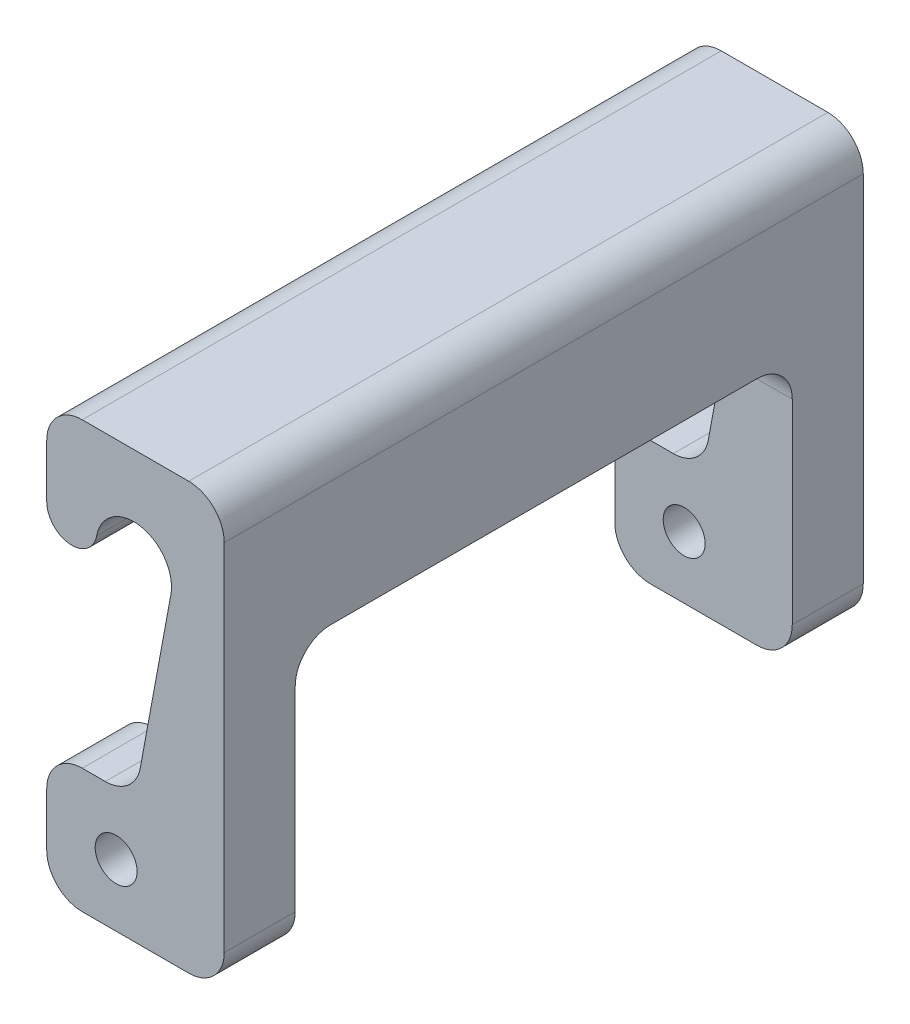
ISO-10303-21;
HEADER;
FILE_DESCRIPTION(('STEP AP214'),'2;1');
FILE_NAME('part.step','',(''),(''),'','','');
FILE_SCHEMA(('AUTOMOTIVE_DESIGN { 1 0 10303 214 1 1 1 1 }'));
ENDSEC;
DATA;
#1=APPLICATION_CONTEXT('core data for automotive mechanical design processes');
#2=APPLICATION_PROTOCOL_DEFINITION('international standard','automotive_design',2000,#1);
#3=PRODUCT_CONTEXT('',#1,'mechanical');
#4=PRODUCT('Part','Part','',(#3));
#5=PRODUCT_RELATED_PRODUCT_CATEGORY('part','',(#4));
#6=PRODUCT_DEFINITION_FORMATION('','',#4);
#7=PRODUCT_DEFINITION_CONTEXT('part definition',#1,'design');
#8=PRODUCT_DEFINITION('design','',#6,#7);
#9=PRODUCT_DEFINITION_SHAPE('','',#8);
#10=(LENGTH_UNIT() NAMED_UNIT(*) SI_UNIT(.MILLI.,.METRE.));
#11=(NAMED_UNIT(*) PLANE_ANGLE_UNIT() SI_UNIT($,.RADIAN.));
#12=(NAMED_UNIT(*) SI_UNIT($,.STERADIAN.) SOLID_ANGLE_UNIT());
#13=UNCERTAINTY_MEASURE_WITH_UNIT(LENGTH_MEASURE(1.E-05),#10,'distance_accuracy_value','');
#14=(GEOMETRIC_REPRESENTATION_CONTEXT(3) GLOBAL_UNCERTAINTY_ASSIGNED_CONTEXT((#13)) GLOBAL_UNIT_ASSIGNED_CONTEXT((#10,
#11,#12)) REPRESENTATION_CONTEXT('',''));
#15=CARTESIAN_POINT('',(0.,0.,0.));
#16=DIRECTION('',(0.,0.,1.));
#17=DIRECTION('',(1.,0.,0.));
#18=AXIS2_PLACEMENT_3D('',#15,#16,#17);
#19=CARTESIAN_POINT('',(0.,8.89,45.72));
#20=DIRECTION('',(0.,-1.,0.));
#21=DIRECTION('',(0.,0.,-1.));
#22=AXIS2_PLACEMENT_3D('',#19,#20,#21);
#23=PLANE('',#22);
#24=DIRECTION('',(0.,0.,-1.));
#25=VECTOR('',#24,1.);
#26=CARTESIAN_POINT('',(4.19391314965813,8.89,45.72));
#27=LINE('',#26,#25);
#28=CARTESIAN_POINT('',(4.19391314965813,8.89,45.72));
#29=VERTEX_POINT('',#28);
#30=CARTESIAN_POINT('',(4.19391314965813,8.89,40.64));
#31=VERTEX_POINT('',#30);
#32=EDGE_CURVE('E235',#29,#31,#27,.T.);
#33=ORIENTED_EDGE('',*,*,#32,.T.);
#34=DIRECTION('',(-1.,0.,0.));
#35=VECTOR('',#34,1.);
#36=CARTESIAN_POINT('',(0.,8.89,40.64));
#37=LINE('',#36,#35);
#38=CARTESIAN_POINT('',(2.54,8.89,40.64));
#39=VERTEX_POINT('',#38);
#40=EDGE_CURVE('E340',#31,#39,#37,.T.);
#41=ORIENTED_EDGE('',*,*,#40,.T.);
#42=DIRECTION('',(0.,0.,-1.));
#43=VECTOR('',#42,1.);
#44=CARTESIAN_POINT('',(2.54,8.89,45.72));
#45=LINE('',#44,#43);
#46=CARTESIAN_POINT('',(2.54,8.89,45.72));
#47=VERTEX_POINT('',#46);
#48=EDGE_CURVE('E272',#47,#39,#45,.T.);
#49=ORIENTED_EDGE('',*,*,#48,.F.);
#50=DIRECTION('',(-1.,0.,0.));
#51=VECTOR('',#50,1.);
#52=CARTESIAN_POINT('',(0.,8.89,45.72));
#53=LINE('',#52,#51);
#54=EDGE_CURVE('E359',#29,#47,#53,.T.);
#55=ORIENTED_EDGE('',*,*,#54,.F.);
#56=EDGE_LOOP('',(#33,#41,#49,#55));
#57=FACE_BOUND('',#56,.T.);
#58=ADVANCED_FACE('F36',(#57),#23,.F.);
#59=CARTESIAN_POINT('',(2.54,6.35,45.72));
#60=DIRECTION('',(0.,0.,-1.));
#61=DIRECTION('',(-1.,0.,0.));
#62=AXIS2_PLACEMENT_3D('',#59,#60,#61);
#63=CYLINDRICAL_SURFACE('',#62,2.54);
#64=ORIENTED_EDGE('',*,*,#48,.T.);
#65=CARTESIAN_POINT('',(2.54,6.35,40.64));
#66=DIRECTION('',(0.,0.,1.));
#67=DIRECTION('',(1.,0.,0.));
#68=AXIS2_PLACEMENT_3D('',#65,#66,#67);
#69=CIRCLE('',#68,2.54);
#70=CARTESIAN_POINT('',(0.,6.35,40.64));
#71=VERTEX_POINT('',#70);
#72=EDGE_CURVE('E343',#39,#71,#69,.T.);
#73=ORIENTED_EDGE('',*,*,#72,.T.);
#74=DIRECTION('',(0.,0.,-1.));
#75=VECTOR('',#74,1.);
#76=CARTESIAN_POINT('',(0.,6.35,45.72));
#77=LINE('',#76,#75);
#78=CARTESIAN_POINT('',(0.,6.35,45.72));
#79=VERTEX_POINT('',#78);
#80=EDGE_CURVE('E268',#79,#71,#77,.T.);
#81=ORIENTED_EDGE('',*,*,#80,.F.);
#82=CARTESIAN_POINT('',(2.54,6.35,45.72));
#83=DIRECTION('',(0.,0.,1.));
#84=DIRECTION('',(1.,0.,0.));
#85=AXIS2_PLACEMENT_3D('',#82,#83,#84);
#86=CIRCLE('',#85,2.54);
#87=EDGE_CURVE('E124',#47,#79,#86,.T.);
#88=ORIENTED_EDGE('',*,*,#87,.F.);
#89=EDGE_LOOP('',(#64,#73,#81,#88));
#90=FACE_BOUND('',#89,.T.);
#91=ADVANCED_FACE('F410',(#90),#63,.T.);
#92=CARTESIAN_POINT('',(0.,0.,45.72));
#93=DIRECTION('',(-1.,0.,0.));
#94=DIRECTION('',(0.,0.,1.));
#95=AXIS2_PLACEMENT_3D('',#92,#93,#94);
#96=PLANE('',#95);
#97=DIRECTION('',(0.,1.,0.));
#98=VECTOR('',#97,1.);
#99=CARTESIAN_POINT('',(0.,0.,40.64));
#100=LINE('',#99,#98);
#101=CARTESIAN_POINT('',(0.,2.54000000000002,40.64));
#102=VERTEX_POINT('',#101);
#103=EDGE_CURVE('E346',#102,#71,#100,.T.);
#104=ORIENTED_EDGE('',*,*,#103,.F.);
#105=DIRECTION('',(0.,0.,-1.));
#106=VECTOR('',#105,1.);
#107=CARTESIAN_POINT('',(0.,2.54000000000002,45.72));
#108=LINE('',#107,#106);
#109=CARTESIAN_POINT('',(0.,2.54000000000002,45.72));
#110=VERTEX_POINT('',#109);
#111=EDGE_CURVE('E264',#110,#102,#108,.T.);
#112=ORIENTED_EDGE('',*,*,#111,.F.);
#113=DIRECTION('',(0.,1.,0.));
#114=VECTOR('',#113,1.);
#115=CARTESIAN_POINT('',(0.,0.,45.72));
#116=LINE('',#115,#114);
#117=EDGE_CURVE('E362',#110,#79,#116,.T.);
#118=ORIENTED_EDGE('',*,*,#117,.T.);
#119=ORIENTED_EDGE('',*,*,#80,.T.);
#120=EDGE_LOOP('',(#104,#112,#118,#119));
#121=FACE_BOUND('',#120,.T.);
#122=ADVANCED_FACE('F416',(#121),#96,.T.);
#123=CARTESIAN_POINT('',(2.54,2.54,45.72));
#124=DIRECTION('',(0.,0.,-1.));
#125=DIRECTION('',(-1.,0.,0.));
#126=AXIS2_PLACEMENT_3D('',#123,#124,#125);
#127=CYLINDRICAL_SURFACE('',#126,2.54);
#128=CARTESIAN_POINT('',(2.54,2.54,40.64));
#129=DIRECTION('',(0.,0.,1.));
#130=DIRECTION('',(1.,0.,0.));
#131=AXIS2_PLACEMENT_3D('',#128,#129,#130);
#132=CIRCLE('',#131,2.54);
#133=CARTESIAN_POINT('',(2.54000000000002,0.,40.64));
#134=VERTEX_POINT('',#133);
#135=EDGE_CURVE('E349',#134,#102,#132,.F.);
#136=ORIENTED_EDGE('',*,*,#135,.F.);
#137=DIRECTION('',(0.,0.,-1.));
#138=VECTOR('',#137,1.);
#139=CARTESIAN_POINT('',(2.54000000000002,0.,45.72));
#140=LINE('',#139,#138);
#141=CARTESIAN_POINT('',(2.54000000000002,0.,45.72));
#142=VERTEX_POINT('',#141);
#143=EDGE_CURVE('E260',#142,#134,#140,.T.);
#144=ORIENTED_EDGE('',*,*,#143,.F.);
#145=CARTESIAN_POINT('',(2.54,2.54,45.72));
#146=DIRECTION('',(0.,0.,1.));
#147=DIRECTION('',(1.,0.,0.));
#148=AXIS2_PLACEMENT_3D('',#145,#146,#147);
#149=CIRCLE('',#148,2.54);
#150=EDGE_CURVE('E365',#142,#110,#149,.F.);
#151=ORIENTED_EDGE('',*,*,#150,.T.);
#152=ORIENTED_EDGE('',*,*,#111,.T.);
#153=EDGE_LOOP('',(#136,#144,#151,#152));
#154=FACE_BOUND('',#153,.T.);
#155=ADVANCED_FACE('F481',(#154),#127,.T.);
#156=CARTESIAN_POINT('',(0.,0.,45.72));
#157=DIRECTION('',(0.,1.,0.));
#158=DIRECTION('',(0.,0.,1.));
#159=AXIS2_PLACEMENT_3D('',#156,#157,#158);
#160=PLANE('',#159);
#161=ORIENTED_EDGE('',*,*,#143,.T.);
#162=DIRECTION('',(1.,0.,0.));
#163=VECTOR('',#162,1.);
#164=CARTESIAN_POINT('',(-12.7,0.,40.64));
#165=LINE('',#164,#163);
#166=CARTESIAN_POINT('',(10.16,0.,40.64));
#167=VERTEX_POINT('',#166);
#168=EDGE_CURVE('E316',#134,#167,#165,.T.);
#169=ORIENTED_EDGE('',*,*,#168,.T.);
#170=DIRECTION('',(0.,0.,-1.));
#171=VECTOR('',#170,1.);
#172=CARTESIAN_POINT('',(10.16,0.,45.72));
#173=LINE('',#172,#171);
#174=CARTESIAN_POINT('',(10.16,0.,45.72));
#175=VERTEX_POINT('',#174);
#176=EDGE_CURVE('E256',#175,#167,#173,.T.);
#177=ORIENTED_EDGE('',*,*,#176,.F.);
#178=DIRECTION('',(1.,0.,0.));
#179=VECTOR('',#178,1.);
#180=CARTESIAN_POINT('',(0.,0.,45.72));
#181=LINE('',#180,#179);
#182=EDGE_CURVE('E368',#142,#175,#181,.T.);
#183=ORIENTED_EDGE('',*,*,#182,.F.);
#184=EDGE_LOOP('',(#161,#169,#177,#183));
#185=FACE_BOUND('',#184,.T.);
#186=ADVANCED_FACE('F682',(#185),#160,.F.);
#187=CARTESIAN_POINT('',(10.16,2.54,45.72));
#188=DIRECTION('',(0.,0.,-1.));
#189=DIRECTION('',(-1.,0.,0.));
#190=AXIS2_PLACEMENT_3D('',#187,#188,#189);
#191=CYLINDRICAL_SURFACE('',#190,2.54);
#192=ORIENTED_EDGE('',*,*,#176,.T.);
#193=CARTESIAN_POINT('',(10.16,2.54,40.64));
#194=DIRECTION('',(0.,0.,1.));
#195=DIRECTION('',(1.,0.,0.));
#196=AXIS2_PLACEMENT_3D('',#193,#194,#195);
#197=CIRCLE('',#196,2.54);
#198=CARTESIAN_POINT('',(12.7,2.54000000000002,40.64));
#199=VERTEX_POINT('',#198);
#200=EDGE_CURVE('E195',#167,#199,#197,.T.);
#201=ORIENTED_EDGE('',*,*,#200,.T.);
#202=DIRECTION('',(0.,0.,-1.));
#203=VECTOR('',#202,1.);
#204=CARTESIAN_POINT('',(12.7,2.54000000000002,45.72));
#205=LINE('',#204,#203);
#206=CARTESIAN_POINT('',(12.7,2.54000000000002,45.72));
#207=VERTEX_POINT('',#206);
#208=EDGE_CURVE('E252',#207,#199,#205,.T.);
#209=ORIENTED_EDGE('',*,*,#208,.F.);
#210=CARTESIAN_POINT('',(10.16,2.54,45.72));
#211=DIRECTION('',(0.,0.,1.));
#212=DIRECTION('',(1.,0.,0.));
#213=AXIS2_PLACEMENT_3D('',#210,#211,#212);
#214=CIRCLE('',#213,2.54);
#215=EDGE_CURVE('E370',#175,#207,#214,.T.);
#216=ORIENTED_EDGE('',*,*,#215,.F.);
#217=EDGE_LOOP('',(#192,#201,#209,#216));
#218=FACE_BOUND('',#217,.T.);
#219=ADVANCED_FACE('F507',(#218),#191,.T.);
#220=CARTESIAN_POINT('',(4.96545990115376,4.445,45.72));
#221=DIRECTION('',(0.,0.,-1.));
#222=DIRECTION('',(-1.,0.,0.));
#223=AXIS2_PLACEMENT_3D('',#220,#221,#222);
#224=CYLINDRICAL_SURFACE('',#223,1.5);
#225=CARTESIAN_POINT('',(4.96545990115376,4.445,40.64));
#226=DIRECTION('',(0.,0.,1.));
#227=DIRECTION('',(1.,0.,0.));
#228=AXIS2_PLACEMENT_3D('',#225,#226,#227);
#229=CIRCLE('',#228,1.5);
#230=CARTESIAN_POINT('',(6.46545990115376,4.445,40.64));
#231=VERTEX_POINT('',#230);
#232=EDGE_CURVE('E352',#231,#231,#229,.T.);
#233=ORIENTED_EDGE('',*,*,#232,.F.);
#234=EDGE_LOOP('',(#233));
#235=FACE_BOUND('',#234,.T.);
#236=CARTESIAN_POINT('',(4.96545990115376,4.445,45.72));
#237=DIRECTION('',(0.,0.,1.));
#238=DIRECTION('',(1.,0.,0.));
#239=AXIS2_PLACEMENT_3D('',#236,#237,#238);
#240=CIRCLE('',#239,1.5);
#241=CARTESIAN_POINT('',(6.46545990115376,4.445,45.72));
#242=VERTEX_POINT('',#241);
#243=EDGE_CURVE('E234',#242,#242,#240,.T.);
#244=ORIENTED_EDGE('',*,*,#243,.T.);
#245=EDGE_LOOP('',(#244));
#246=FACE_BOUND('',#245,.T.);
#247=ADVANCED_FACE('F427',(#235,#246),#224,.F.);
#248=CARTESIAN_POINT('',(4.19391314965813,11.43,45.72));
#249=DIRECTION('',(0.,0.,-1.));
#250=DIRECTION('',(-1.,0.,0.));
#251=AXIS2_PLACEMENT_3D('',#248,#249,#250);
#252=CYLINDRICAL_SURFACE('',#251,2.54);
#253=DIRECTION('',(0.,0.,-1.));
#254=VECTOR('',#253,1.);
#255=CARTESIAN_POINT('',(6.69161647701009,10.9683961779459,45.72));
#256=LINE('',#255,#254);
#257=CARTESIAN_POINT('',(6.69161647701009,10.9683961779459,45.72));
#258=VERTEX_POINT('',#257);
#259=CARTESIAN_POINT('',(6.6916164770101,10.9683961779459,40.64));
#260=VERTEX_POINT('',#259);
#261=EDGE_CURVE('E182',#258,#260,#256,.T.);
#262=ORIENTED_EDGE('',*,*,#261,.T.);
#263=CARTESIAN_POINT('',(4.19391314965813,11.43,40.64));
#264=DIRECTION('',(0.,0.,1.));
#265=DIRECTION('',(1.,0.,0.));
#266=AXIS2_PLACEMENT_3D('',#263,#264,#265);
#267=CIRCLE('',#266,2.54);
#268=EDGE_CURVE('E276',#260,#31,#267,.F.);
#269=ORIENTED_EDGE('',*,*,#268,.T.);
#270=ORIENTED_EDGE('',*,*,#32,.F.);
#271=CARTESIAN_POINT('',(4.19391314965813,11.43,45.72));
#272=DIRECTION('',(0.,0.,1.));
#273=DIRECTION('',(1.,0.,0.));
#274=AXIS2_PLACEMENT_3D('',#271,#272,#273);
#275=CIRCLE('',#274,2.54);
#276=EDGE_CURVE('E60',#258,#29,#275,.F.);
#277=ORIENTED_EDGE('',*,*,#276,.F.);
#278=EDGE_LOOP('',(#262,#269,#270,#277));
#279=FACE_BOUND('',#278,.T.);
#280=ADVANCED_FACE('F420',(#279),#252,.F.);
#281=CARTESIAN_POINT('',(2.54,8.89,5.08));
#282=VERTEX_POINT('',#281);
#283=CARTESIAN_POINT('',(2.54,8.89,0.));
#284=VERTEX_POINT('',#283);
#285=EDGE_CURVE('E271',#282,#284,#45,.T.);
#286=ORIENTED_EDGE('',*,*,#285,.F.);
#287=DIRECTION('',(1.,0.,0.));
#288=VECTOR('',#287,1.);
#289=CARTESIAN_POINT('',(0.,8.89,5.08));
#290=LINE('',#289,#288);
#291=CARTESIAN_POINT('',(4.19391314965813,8.89,5.08));
#292=VERTEX_POINT('',#291);
#293=EDGE_CURVE('E321',#282,#292,#290,.T.);
#294=ORIENTED_EDGE('',*,*,#293,.T.);
#295=CARTESIAN_POINT('',(4.19391314965813,8.89,0.));
#296=VERTEX_POINT('',#295);
#297=EDGE_CURVE('E115',#292,#296,#27,.T.);
#298=ORIENTED_EDGE('',*,*,#297,.T.);
#299=DIRECTION('',(-1.,0.,0.));
#300=VECTOR('',#299,1.);
#301=CARTESIAN_POINT('',(0.,8.89,0.));
#302=LINE('',#301,#300);
#303=EDGE_CURVE('E194',#296,#284,#302,.T.);
#304=ORIENTED_EDGE('',*,*,#303,.T.);
#305=EDGE_LOOP('',(#286,#294,#298,#304));
#306=FACE_BOUND('',#305,.T.);
#307=ADVANCED_FACE('F412',(#306),#23,.F.);
#308=CARTESIAN_POINT('',(0.,6.35,5.08));
#309=VERTEX_POINT('',#308);
#310=CARTESIAN_POINT('',(0.,6.35,0.));
#311=VERTEX_POINT('',#310);
#312=EDGE_CURVE('E267',#309,#311,#77,.T.);
#313=ORIENTED_EDGE('',*,*,#312,.F.);
#314=CARTESIAN_POINT('',(2.54,6.35,5.08));
#315=DIRECTION('',(0.,0.,-1.));
#316=DIRECTION('',(0.,1.,0.));
#317=AXIS2_PLACEMENT_3D('',#314,#315,#316);
#318=CIRCLE('',#317,2.54);
#319=EDGE_CURVE('E323',#309,#282,#318,.T.);
#320=ORIENTED_EDGE('',*,*,#319,.T.);
#321=ORIENTED_EDGE('',*,*,#285,.T.);
#322=CARTESIAN_POINT('',(2.54,6.35,0.));
#323=DIRECTION('',(0.,0.,1.));
#324=DIRECTION('',(1.,0.,0.));
#325=AXIS2_PLACEMENT_3D('',#322,#323,#324);
#326=CIRCLE('',#325,2.54);
#327=EDGE_CURVE('E197',#284,#311,#326,.T.);
#328=ORIENTED_EDGE('',*,*,#327,.T.);
#329=EDGE_LOOP('',(#313,#320,#321,#328));
#330=FACE_BOUND('',#329,.T.);
#331=ADVANCED_FACE('F418',(#330),#63,.T.);
#332=DIRECTION('',(0.,-1.,0.));
#333=VECTOR('',#332,1.);
#334=CARTESIAN_POINT('',(0.,0.,5.08));
#335=LINE('',#334,#333);
#336=CARTESIAN_POINT('',(0.,2.54000000000002,5.08));
#337=VERTEX_POINT('',#336);
#338=EDGE_CURVE('E326',#309,#337,#335,.T.);
#339=ORIENTED_EDGE('',*,*,#338,.F.);
#340=ORIENTED_EDGE('',*,*,#312,.T.);
#341=DIRECTION('',(0.,1.,0.));
#342=VECTOR('',#341,1.);
#343=CARTESIAN_POINT('',(0.,0.,0.));
#344=LINE('',#343,#342);
#345=CARTESIAN_POINT('',(0.,2.54000000000002,0.));
#346=VERTEX_POINT('',#345);
#347=EDGE_CURVE('E200',#346,#311,#344,.T.);
#348=ORIENTED_EDGE('',*,*,#347,.F.);
#349=EDGE_CURVE('E263',#337,#346,#108,.T.);
#350=ORIENTED_EDGE('',*,*,#349,.F.);
#351=EDGE_LOOP('',(#339,#340,#348,#350));
#352=FACE_BOUND('',#351,.T.);
#353=ADVANCED_FACE('F425',(#352),#96,.T.);
#354=CARTESIAN_POINT('',(2.54,2.54,5.08));
#355=DIRECTION('',(0.,0.,-1.));
#356=DIRECTION('',(0.,1.,0.));
#357=AXIS2_PLACEMENT_3D('',#354,#355,#356);
#358=CIRCLE('',#357,2.54);
#359=CARTESIAN_POINT('',(2.54000000000002,0.,5.08));
#360=VERTEX_POINT('',#359);
#361=EDGE_CURVE('E329',#337,#360,#358,.F.);
#362=ORIENTED_EDGE('',*,*,#361,.F.);
#363=ORIENTED_EDGE('',*,*,#349,.T.);
#364=CARTESIAN_POINT('',(2.54,2.54,0.));
#365=DIRECTION('',(0.,0.,1.));
#366=DIRECTION('',(1.,0.,0.));
#367=AXIS2_PLACEMENT_3D('',#364,#365,#366);
#368=CIRCLE('',#367,2.54);
#369=CARTESIAN_POINT('',(2.54000000000002,0.,0.));
#370=VERTEX_POINT('',#369);
#371=EDGE_CURVE('E203',#370,#346,#368,.F.);
#372=ORIENTED_EDGE('',*,*,#371,.F.);
#373=EDGE_CURVE('E259',#360,#370,#140,.T.);
#374=ORIENTED_EDGE('',*,*,#373,.F.);
#375=EDGE_LOOP('',(#362,#363,#372,#374));
#376=FACE_BOUND('',#375,.T.);
#377=ADVANCED_FACE('F529',(#376),#127,.T.);
#378=CARTESIAN_POINT('',(10.16,0.,5.08));
#379=VERTEX_POINT('',#378);
#380=CARTESIAN_POINT('',(10.16,0.,0.));
#381=VERTEX_POINT('',#380);
#382=EDGE_CURVE('E255',#379,#381,#173,.T.);
#383=ORIENTED_EDGE('',*,*,#382,.F.);
#384=DIRECTION('',(1.,0.,0.));
#385=VECTOR('',#384,1.);
#386=CARTESIAN_POINT('',(-12.7,0.,5.08));
#387=LINE('',#386,#385);
#388=EDGE_CURVE('E310',#360,#379,#387,.T.);
#389=ORIENTED_EDGE('',*,*,#388,.F.);
#390=ORIENTED_EDGE('',*,*,#373,.T.);
#391=DIRECTION('',(1.,0.,0.));
#392=VECTOR('',#391,1.);
#393=CARTESIAN_POINT('',(0.,0.,0.));
#394=LINE('',#393,#392);
#395=EDGE_CURVE('E206',#370,#381,#394,.T.);
#396=ORIENTED_EDGE('',*,*,#395,.T.);
#397=EDGE_LOOP('',(#383,#389,#390,#396));
#398=FACE_BOUND('',#397,.T.);
#399=ADVANCED_FACE('F536',(#398),#160,.F.);
#400=CARTESIAN_POINT('',(12.7,2.54000000000002,5.08));
#401=VERTEX_POINT('',#400);
#402=CARTESIAN_POINT('',(12.7,2.54000000000002,0.));
#403=VERTEX_POINT('',#402);
#404=EDGE_CURVE('E251',#401,#403,#205,.T.);
#405=ORIENTED_EDGE('',*,*,#404,.F.);
#406=CARTESIAN_POINT('',(10.16,2.54,5.08));
#407=DIRECTION('',(0.,0.,-1.));
#408=DIRECTION('',(0.,1.,0.));
#409=AXIS2_PLACEMENT_3D('',#406,#407,#408);
#410=CIRCLE('',#409,2.54);
#411=EDGE_CURVE('E335',#401,#379,#410,.T.);
#412=ORIENTED_EDGE('',*,*,#411,.T.);
#413=ORIENTED_EDGE('',*,*,#382,.T.);
#414=CARTESIAN_POINT('',(10.16,2.54,0.));
#415=DIRECTION('',(0.,0.,1.));
#416=DIRECTION('',(1.,0.,0.));
#417=AXIS2_PLACEMENT_3D('',#414,#415,#416);
#418=CIRCLE('',#417,2.54);
#419=EDGE_CURVE('E209',#381,#403,#418,.T.);
#420=ORIENTED_EDGE('',*,*,#419,.T.);
#421=EDGE_LOOP('',(#405,#412,#413,#420));
#422=FACE_BOUND('',#421,.T.);
#423=ADVANCED_FACE('F523',(#422),#191,.T.);
#424=CARTESIAN_POINT('',(12.7,0.,45.72));
#425=DIRECTION('',(-1.,0.,0.));
#426=DIRECTION('',(0.,0.,1.));
#427=AXIS2_PLACEMENT_3D('',#424,#425,#426);
#428=PLANE('',#427);
#429=ORIENTED_EDGE('',*,*,#208,.T.);
#430=DIRECTION('',(0.,-1.,0.));
#431=VECTOR('',#430,1.);
#432=CARTESIAN_POINT('',(12.7,0.,40.64));
#433=LINE('',#432,#431);
#434=CARTESIAN_POINT('',(12.7,16.51,40.64));
#435=VERTEX_POINT('',#434);
#436=EDGE_CURVE('E503',#435,#199,#433,.T.);
#437=ORIENTED_EDGE('',*,*,#436,.F.);
#438=CARTESIAN_POINT('',(12.7,16.51,38.1));
#439=DIRECTION('',(1.,0.,0.));
#440=DIRECTION('',(0.,0.,1.));
#441=AXIS2_PLACEMENT_3D('',#438,#439,#440);
#442=CIRCLE('',#441,2.54);
#443=CARTESIAN_POINT('',(12.7,19.05,38.1));
#444=VERTEX_POINT('',#443);
#445=EDGE_CURVE('E319',#444,#435,#442,.T.);
#446=ORIENTED_EDGE('',*,*,#445,.F.);
#447=DIRECTION('',(0.,0.,1.));
#448=VECTOR('',#447,1.);
#449=CARTESIAN_POINT('',(12.7,19.05,38.1));
#450=LINE('',#449,#448);
#451=CARTESIAN_POINT('',(12.7,19.05,7.62));
#452=VERTEX_POINT('',#451);
#453=EDGE_CURVE('E497',#452,#444,#450,.T.);
#454=ORIENTED_EDGE('',*,*,#453,.F.);
#455=CARTESIAN_POINT('',(12.7,16.51,7.62));
#456=DIRECTION('',(1.,0.,0.));
#457=DIRECTION('',(0.,0.,1.));
#458=AXIS2_PLACEMENT_3D('',#455,#456,#457);
#459=CIRCLE('',#458,2.54);
#460=CARTESIAN_POINT('',(12.7,16.51,5.08));
#461=VERTEX_POINT('',#460);
#462=EDGE_CURVE('E304',#461,#452,#459,.T.);
#463=ORIENTED_EDGE('',*,*,#462,.F.);
#464=DIRECTION('',(0.,1.,0.));
#465=VECTOR('',#464,1.);
#466=CARTESIAN_POINT('',(12.7,0.,5.08));
#467=LINE('',#466,#465);
#468=EDGE_CURVE('E500',#401,#461,#467,.T.);
#469=ORIENTED_EDGE('',*,*,#468,.F.);
#470=ORIENTED_EDGE('',*,*,#404,.T.);
#471=DIRECTION('',(0.,1.,0.));
#472=VECTOR('',#471,1.);
#473=CARTESIAN_POINT('',(12.7,0.,0.));
#474=LINE('',#473,#472);
#475=CARTESIAN_POINT('',(12.7,27.94,0.));
#476=VERTEX_POINT('',#475);
#477=EDGE_CURVE('E212',#403,#476,#474,.T.);
#478=ORIENTED_EDGE('',*,*,#477,.T.);
#479=DIRECTION('',(0.,0.,-1.));
#480=VECTOR('',#479,1.);
#481=CARTESIAN_POINT('',(12.7,27.94,45.72));
#482=LINE('',#481,#480);
#483=CARTESIAN_POINT('',(12.7,27.94,45.72));
#484=VERTEX_POINT('',#483);
#485=EDGE_CURVE('E249',#484,#476,#482,.T.);
#486=ORIENTED_EDGE('',*,*,#485,.F.);
#487=DIRECTION('',(0.,1.,0.));
#488=VECTOR('',#487,1.);
#489=CARTESIAN_POINT('',(12.7,0.,45.72));
#490=LINE('',#489,#488);
#491=EDGE_CURVE('E372',#207,#484,#490,.T.);
#492=ORIENTED_EDGE('',*,*,#491,.F.);
#493=EDGE_LOOP('',(#429,#437,#446,#454,#463,#469,#470,#478,#486,#492));
#494=FACE_BOUND('',#493,.T.);
#495=ADVANCED_FACE('F510',(#494),#428,.F.);
#496=CARTESIAN_POINT('',(10.16,27.94,45.72));
#497=DIRECTION('',(0.,0.,-1.));
#498=DIRECTION('',(-1.,0.,0.));
#499=AXIS2_PLACEMENT_3D('',#496,#497,#498);
#500=CYLINDRICAL_SURFACE('',#499,2.54);
#501=CARTESIAN_POINT('',(10.16,27.94,0.));
#502=DIRECTION('',(0.,0.,1.));
#503=DIRECTION('',(1.,0.,0.));
#504=AXIS2_PLACEMENT_3D('',#501,#502,#503);
#505=CIRCLE('',#504,2.54);
#506=CARTESIAN_POINT('',(10.16,30.48,0.));
#507=VERTEX_POINT('',#506);
#508=EDGE_CURVE('E215',#507,#476,#505,.F.);
#509=ORIENTED_EDGE('',*,*,#508,.F.);
#510=DIRECTION('',(0.,0.,-1.));
#511=VECTOR('',#510,1.);
#512=CARTESIAN_POINT('',(10.16,30.48,45.72));
#513=LINE('',#512,#511);
#514=CARTESIAN_POINT('',(10.16,30.48,45.72));
#515=VERTEX_POINT('',#514);
#516=EDGE_CURVE('E247',#515,#507,#513,.T.);
#517=ORIENTED_EDGE('',*,*,#516,.F.);
#518=CARTESIAN_POINT('',(10.16,27.94,45.72));
#519=DIRECTION('',(0.,0.,1.));
#520=DIRECTION('',(1.,0.,0.));
#521=AXIS2_PLACEMENT_3D('',#518,#519,#520);
#522=CIRCLE('',#521,2.54);
#523=EDGE_CURVE('E374',#515,#484,#522,.F.);
#524=ORIENTED_EDGE('',*,*,#523,.T.);
#525=ORIENTED_EDGE('',*,*,#485,.T.);
#526=EDGE_LOOP('',(#509,#517,#524,#525));
#527=FACE_BOUND('',#526,.T.);
#528=ADVANCED_FACE('F518',(#527),#500,.T.);
#529=CARTESIAN_POINT('',(0.,30.48,45.72));
#530=DIRECTION('',(0.,1.,0.));
#531=DIRECTION('',(0.,0.,1.));
#532=AXIS2_PLACEMENT_3D('',#529,#530,#531);
#533=PLANE('',#532);
#534=DIRECTION('',(1.,0.,0.));
#535=VECTOR('',#534,1.);
#536=CARTESIAN_POINT('',(0.,30.48,0.));
#537=LINE('',#536,#535);
#538=CARTESIAN_POINT('',(2.54,30.48,0.));
#539=VERTEX_POINT('',#538);
#540=EDGE_CURVE('E218',#539,#507,#537,.T.);
#541=ORIENTED_EDGE('',*,*,#540,.F.);
#542=DIRECTION('',(0.,0.,-1.));
#543=VECTOR('',#542,1.);
#544=CARTESIAN_POINT('',(2.54,30.48,45.72));
#545=LINE('',#544,#543);
#546=CARTESIAN_POINT('',(2.54,30.48,45.72));
#547=VERTEX_POINT('',#546);
#548=EDGE_CURVE('E245',#547,#539,#545,.T.);
#549=ORIENTED_EDGE('',*,*,#548,.F.);
#550=DIRECTION('',(1.,0.,0.));
#551=VECTOR('',#550,1.);
#552=CARTESIAN_POINT('',(0.,30.48,45.72));
#553=LINE('',#552,#551);
#554=EDGE_CURVE('E377',#547,#515,#553,.T.);
#555=ORIENTED_EDGE('',*,*,#554,.T.);
#556=ORIENTED_EDGE('',*,*,#516,.T.);
#557=EDGE_LOOP('',(#541,#549,#555,#556));
#558=FACE_BOUND('',#557,.T.);
#559=ADVANCED_FACE('F514',(#558),#533,.T.);
#560=CARTESIAN_POINT('',(2.54,27.94,45.72));
#561=DIRECTION('',(0.,0.,-1.));
#562=DIRECTION('',(-1.,0.,0.));
#563=AXIS2_PLACEMENT_3D('',#560,#561,#562);
#564=CYLINDRICAL_SURFACE('',#563,2.54);
#565=CARTESIAN_POINT('',(2.54,27.94,0.));
#566=DIRECTION('',(0.,0.,1.));
#567=DIRECTION('',(1.,0.,0.));
#568=AXIS2_PLACEMENT_3D('',#565,#566,#567);
#569=CIRCLE('',#568,2.54);
#570=CARTESIAN_POINT('',(0.,27.94,0.));
#571=VERTEX_POINT('',#570);
#572=EDGE_CURVE('E221',#571,#539,#569,.F.);
#573=ORIENTED_EDGE('',*,*,#572,.F.);
#574=DIRECTION('',(0.,0.,-1.));
#575=VECTOR('',#574,1.);
#576=CARTESIAN_POINT('',(0.,27.94,45.72));
#577=LINE('',#576,#575);
#578=CARTESIAN_POINT('',(0.,27.94,45.72));
#579=VERTEX_POINT('',#578);
#580=EDGE_CURVE('E243',#579,#571,#577,.T.);
#581=ORIENTED_EDGE('',*,*,#580,.F.);
#582=CARTESIAN_POINT('',(2.54,27.94,45.72));
#583=DIRECTION('',(0.,0.,1.));
#584=DIRECTION('',(1.,0.,0.));
#585=AXIS2_PLACEMENT_3D('',#582,#583,#584);
#586=CIRCLE('',#585,2.54);
#587=EDGE_CURVE('E380',#579,#547,#586,.F.);
#588=ORIENTED_EDGE('',*,*,#587,.T.);
#589=ORIENTED_EDGE('',*,*,#548,.T.);
#590=EDGE_LOOP('',(#573,#581,#588,#589));
#591=FACE_BOUND('',#590,.T.);
#592=ADVANCED_FACE('F393',(#591),#564,.T.);
#593=CARTESIAN_POINT('',(0.,0.,45.72));
#594=DIRECTION('',(-1.,0.,0.));
#595=DIRECTION('',(0.,0.,1.));
#596=AXIS2_PLACEMENT_3D('',#593,#594,#595);
#597=PLANE('',#596);
#598=DIRECTION('',(0.,1.,0.));
#599=VECTOR('',#598,1.);
#600=CARTESIAN_POINT('',(0.,0.,0.));
#601=LINE('',#600,#599);
#602=CARTESIAN_POINT('',(0.,24.13,0.));
#603=VERTEX_POINT('',#602);
#604=EDGE_CURVE('E224',#603,#571,#601,.T.);
#605=ORIENTED_EDGE('',*,*,#604,.F.);
#606=DIRECTION('',(0.,0.,-1.));
#607=VECTOR('',#606,1.);
#608=CARTESIAN_POINT('',(0.,24.13,45.72));
#609=LINE('',#608,#607);
#610=CARTESIAN_POINT('',(0.,24.13,45.72));
#611=VERTEX_POINT('',#610);
#612=EDGE_CURVE('E241',#611,#603,#609,.T.);
#613=ORIENTED_EDGE('',*,*,#612,.F.);
#614=DIRECTION('',(0.,1.,0.));
#615=VECTOR('',#614,1.);
#616=CARTESIAN_POINT('',(0.,0.,45.72));
#617=LINE('',#616,#615);
#618=EDGE_CURVE('E383',#611,#579,#617,.T.);
#619=ORIENTED_EDGE('',*,*,#618,.T.);
#620=ORIENTED_EDGE('',*,*,#580,.T.);
#621=EDGE_LOOP('',(#605,#613,#619,#620));
#622=FACE_BOUND('',#621,.T.);
#623=ADVANCED_FACE('F387',(#622),#597,.T.);
#624=CARTESIAN_POINT('',(1.80078185572796,24.13,45.72));
#625=DIRECTION('',(0.,0.,-1.));
#626=DIRECTION('',(-1.,0.,0.));
#627=AXIS2_PLACEMENT_3D('',#624,#625,#626);
#628=CYLINDRICAL_SURFACE('',#627,1.80078185572796);
#629=CARTESIAN_POINT('',(1.80078185572796,24.13,0.));
#630=DIRECTION('',(0.,0.,1.));
#631=DIRECTION('',(1.,0.,0.));
#632=AXIS2_PLACEMENT_3D('',#629,#630,#631);
#633=CIRCLE('',#632,1.80078185572796);
#634=CARTESIAN_POINT('',(3.57157667182511,23.8027370916182,0.));
#635=VERTEX_POINT('',#634);
#636=EDGE_CURVE('E227',#603,#635,#633,.T.);
#637=ORIENTED_EDGE('',*,*,#636,.T.);
#638=DIRECTION('',(0.,0.,-1.));
#639=VECTOR('',#638,1.);
#640=CARTESIAN_POINT('',(3.57157667182511,23.8027370916182,45.72));
#641=LINE('',#640,#639);
#642=CARTESIAN_POINT('',(3.57157667182511,23.8027370916182,45.72));
#643=VERTEX_POINT('',#642);
#644=EDGE_CURVE('E181',#643,#635,#641,.T.);
#645=ORIENTED_EDGE('',*,*,#644,.F.);
#646=CARTESIAN_POINT('',(1.80078185572796,24.13,45.72));
#647=DIRECTION('',(0.,0.,1.));
#648=DIRECTION('',(1.,0.,0.));
#649=AXIS2_PLACEMENT_3D('',#646,#647,#648);
#650=CIRCLE('',#649,1.80078185572796);
#651=EDGE_CURVE('E168',#611,#643,#650,.T.);
#652=ORIENTED_EDGE('',*,*,#651,.F.);
#653=ORIENTED_EDGE('',*,*,#612,.T.);
#654=EDGE_LOOP('',(#637,#645,#652,#653));
#655=FACE_BOUND('',#654,.T.);
#656=ADVANCED_FACE('F400',(#655),#628,.T.);
#657=CARTESIAN_POINT('',(6.22687011640835,23.3120088336733,45.72));
#658=DIRECTION('',(0.,0.,-1.));
#659=DIRECTION('',(-1.,0.,0.));
#660=AXIS2_PLACEMENT_3D('',#657,#658,#659);
#661=CYLINDRICAL_SURFACE('',#660,2.7002587838932);
#662=CARTESIAN_POINT('',(6.22687011640835,23.3120088336733,0.));
#663=DIRECTION('',(0.,0.,1.));
#664=DIRECTION('',(1.,0.,0.));
#665=AXIS2_PLACEMENT_3D('',#662,#663,#664);
#666=CIRCLE('',#665,2.7002587838932);
#667=CARTESIAN_POINT('',(8.88216356099158,22.8212805757283,0.));
#668=VERTEX_POINT('',#667);
#669=EDGE_CURVE('E177',#635,#668,#666,.F.);
#670=ORIENTED_EDGE('',*,*,#669,.T.);
#671=DIRECTION('',(0.,0.,-1.));
#672=VECTOR('',#671,1.);
#673=CARTESIAN_POINT('',(8.88216356099158,22.8212805757283,45.72));
#674=LINE('',#673,#672);
#675=CARTESIAN_POINT('',(8.88216356099158,22.8212805757283,45.72));
#676=VERTEX_POINT('',#675);
#677=EDGE_CURVE('E174',#676,#668,#674,.T.);
#678=ORIENTED_EDGE('',*,*,#677,.F.);
#679=CARTESIAN_POINT('',(6.22687011640835,23.3120088336733,45.72));
#680=DIRECTION('',(0.,0.,1.));
#681=DIRECTION('',(1.,0.,0.));
#682=AXIS2_PLACEMENT_3D('',#679,#680,#681);
#683=CIRCLE('',#682,2.7002587838932);
#684=EDGE_CURVE('E160',#643,#676,#683,.F.);
#685=ORIENTED_EDGE('',*,*,#684,.F.);
#686=ORIENTED_EDGE('',*,*,#644,.T.);
#687=EDGE_LOOP('',(#670,#678,#685,#686));
#688=FACE_BOUND('',#687,.T.);
#689=ADVANCED_FACE('F175',(#688),#661,.F.);
#690=CARTESIAN_POINT('',(4.51047650161242,-0.833587067618975,45.72));
#691=DIRECTION('',(0.983347766674,-0.181733788210274,0.));
#692=DIRECTION('',(0.181733788210274,0.983347766674,0.));
#693=AXIS2_PLACEMENT_3D('',#690,#691,#692);
#694=PLANE('',#693);
#695=CARTESIAN_POINT('',(7.71576753472668,16.51,38.1));
#696=DIRECTION('',(0.983347766674,-0.181733788210274,0.));
#697=DIRECTION('',(0.181733788210274,0.983347766674,0.));
#698=AXIS2_PLACEMENT_3D('',#695,#696,#697);
#699=ELLIPSE('',#698,2.58301293406208,2.54);
#700=CARTESIAN_POINT('',(8.18518826022992,19.05,38.1));
#701=VERTEX_POINT('',#700);
#702=CARTESIAN_POINT('',(7.71576753472668,16.51,40.64));
#703=VERTEX_POINT('',#702);
#704=EDGE_CURVE('E11',#701,#703,#699,.T.);
#705=ORIENTED_EDGE('',*,*,#704,.T.);
#706=DIRECTION('',(-0.181733788210274,-0.983347766674,0.));
#707=VECTOR('',#706,1.);
#708=CARTESIAN_POINT('',(4.51047650161242,-0.833587067618975,40.64));
#709=LINE('',#708,#707);
#710=EDGE_CURVE('E338',#703,#260,#709,.T.);
#711=ORIENTED_EDGE('',*,*,#710,.T.);
#712=ORIENTED_EDGE('',*,*,#261,.F.);
#713=DIRECTION('',(-0.181733788210274,-0.983347766674,0.));
#714=VECTOR('',#713,1.);
#715=CARTESIAN_POINT('',(4.51047650161242,-0.833587067618975,45.72));
#716=LINE('',#715,#714);
#717=EDGE_CURVE('E164',#676,#258,#716,.T.);
#718=ORIENTED_EDGE('',*,*,#717,.F.);
#719=ORIENTED_EDGE('',*,*,#677,.T.);
#720=DIRECTION('',(-0.181733788210274,-0.983347766674,0.));
#721=VECTOR('',#720,1.);
#722=CARTESIAN_POINT('',(4.51047650161242,-0.833587067618975,0.));
#723=LINE('',#722,#721);
#724=CARTESIAN_POINT('',(6.69161647701009,10.9683961779459,0.));
#725=VERTEX_POINT('',#724);
#726=EDGE_CURVE('E230',#668,#725,#723,.T.);
#727=ORIENTED_EDGE('',*,*,#726,.T.);
#728=CARTESIAN_POINT('',(6.69161647701009,10.9683961779459,5.08));
#729=VERTEX_POINT('',#728);
#730=EDGE_CURVE('E238',#729,#725,#256,.T.);
#731=ORIENTED_EDGE('',*,*,#730,.F.);
#732=DIRECTION('',(0.181733788210274,0.983347766674,0.));
#733=VECTOR('',#732,1.);
#734=CARTESIAN_POINT('',(4.51047650161242,-0.833587067618979,5.08));
#735=LINE('',#734,#733);
#736=CARTESIAN_POINT('',(7.71576753472668,16.51,5.08));
#737=VERTEX_POINT('',#736);
#738=EDGE_CURVE('E51',#729,#737,#735,.T.);
#739=ORIENTED_EDGE('',*,*,#738,.T.);
#740=CARTESIAN_POINT('',(7.71576753472668,16.51,7.62));
#741=DIRECTION('',(0.983347766674,-0.181733788210274,0.));
#742=DIRECTION('',(0.181733788210274,0.983347766674,0.));
#743=AXIS2_PLACEMENT_3D('',#740,#741,#742);
#744=ELLIPSE('',#743,2.58301293406208,2.54);
#745=CARTESIAN_POINT('',(8.18518826022992,19.05,7.62));
#746=VERTEX_POINT('',#745);
#747=EDGE_CURVE('E279',#737,#746,#744,.T.);
#748=ORIENTED_EDGE('',*,*,#747,.T.);
#749=DIRECTION('',(0.,0.,1.));
#750=VECTOR('',#749,1.);
#751=CARTESIAN_POINT('',(8.18518826022992,19.05,45.72));
#752=LINE('',#751,#750);
#753=EDGE_CURVE('E44',#746,#701,#752,.T.);
#754=ORIENTED_EDGE('',*,*,#753,.T.);
#755=EDGE_LOOP('',(#705,#711,#712,#718,#719,#727,#731,#739,#748,#754));
#756=FACE_BOUND('',#755,.T.);
#757=ADVANCED_FACE('F184',(#756),#694,.F.);
#758=CARTESIAN_POINT('',(4.96545990115376,4.445,5.08));
#759=DIRECTION('',(0.,0.,-1.));
#760=DIRECTION('',(0.,1.,0.));
#761=AXIS2_PLACEMENT_3D('',#758,#759,#760);
#762=CIRCLE('',#761,1.5);
#763=CARTESIAN_POINT('',(4.96545990115376,5.945,5.08));
#764=VERTEX_POINT('',#763);
#765=EDGE_CURVE('E332',#764,#764,#762,.T.);
#766=ORIENTED_EDGE('',*,*,#765,.F.);
#767=EDGE_LOOP('',(#766));
#768=FACE_BOUND('',#767,.T.);
#769=CARTESIAN_POINT('',(4.96545990115376,4.445,0.));
#770=DIRECTION('',(0.,0.,1.));
#771=DIRECTION('',(1.,0.,0.));
#772=AXIS2_PLACEMENT_3D('',#769,#770,#771);
#773=CIRCLE('',#772,1.5);
#774=CARTESIAN_POINT('',(6.46545990115376,4.445,0.));
#775=VERTEX_POINT('',#774);
#776=EDGE_CURVE('E191',#775,#775,#773,.T.);
#777=ORIENTED_EDGE('',*,*,#776,.F.);
#778=EDGE_LOOP('',(#777));
#779=FACE_BOUND('',#778,.T.);
#780=ADVANCED_FACE('F38',(#768,#779),#224,.F.);
#781=ORIENTED_EDGE('',*,*,#297,.F.);
#782=CARTESIAN_POINT('',(4.19391314965813,11.43,5.08));
#783=DIRECTION('',(0.,0.,-1.));
#784=DIRECTION('',(0.,1.,0.));
#785=AXIS2_PLACEMENT_3D('',#782,#783,#784);
#786=CIRCLE('',#785,2.54);
#787=EDGE_CURVE('E274',#292,#729,#786,.F.);
#788=ORIENTED_EDGE('',*,*,#787,.T.);
#789=ORIENTED_EDGE('',*,*,#730,.T.);
#790=CARTESIAN_POINT('',(4.19391314965813,11.43,0.));
#791=DIRECTION('',(0.,0.,1.));
#792=DIRECTION('',(1.,0.,0.));
#793=AXIS2_PLACEMENT_3D('',#790,#791,#792);
#794=CIRCLE('',#793,2.54);
#795=EDGE_CURVE('E232',#725,#296,#794,.F.);
#796=ORIENTED_EDGE('',*,*,#795,.T.);
#797=EDGE_LOOP('',(#781,#788,#789,#796));
#798=FACE_BOUND('',#797,.T.);
#799=ADVANCED_FACE('F430',(#798),#252,.F.);
#800=CARTESIAN_POINT('',(0.,0.,45.72));
#801=DIRECTION('',(0.,0.,1.));
#802=DIRECTION('',(1.,0.,0.));
#803=AXIS2_PLACEMENT_3D('',#800,#801,#802);
#804=PLANE('',#803);
#805=ORIENTED_EDGE('',*,*,#243,.F.);
#806=EDGE_LOOP('',(#805));
#807=FACE_BOUND('',#806,.T.);
#808=ORIENTED_EDGE('',*,*,#54,.T.);
#809=ORIENTED_EDGE('',*,*,#87,.T.);
#810=ORIENTED_EDGE('',*,*,#117,.F.);
#811=ORIENTED_EDGE('',*,*,#150,.F.);
#812=ORIENTED_EDGE('',*,*,#182,.T.);
#813=ORIENTED_EDGE('',*,*,#215,.T.);
#814=ORIENTED_EDGE('',*,*,#491,.T.);
#815=ORIENTED_EDGE('',*,*,#523,.F.);
#816=ORIENTED_EDGE('',*,*,#554,.F.);
#817=ORIENTED_EDGE('',*,*,#587,.F.);
#818=ORIENTED_EDGE('',*,*,#618,.F.);
#819=ORIENTED_EDGE('',*,*,#651,.T.);
#820=ORIENTED_EDGE('',*,*,#684,.T.);
#821=ORIENTED_EDGE('',*,*,#717,.T.);
#822=ORIENTED_EDGE('',*,*,#276,.T.);
#823=EDGE_LOOP('',(#808,#809,#810,#811,#812,#813,#814,#815,#816,#817,#818,#819,#820,#821,#822));
#824=FACE_BOUND('',#823,.T.);
#825=ADVANCED_FACE('F162',(#807,#824),#804,.T.);
#826=CARTESIAN_POINT('',(0.,0.,0.));
#827=DIRECTION('',(0.,0.,1.));
#828=DIRECTION('',(1.,0.,0.));
#829=AXIS2_PLACEMENT_3D('',#826,#827,#828);
#830=PLANE('',#829);
#831=ORIENTED_EDGE('',*,*,#776,.T.);
#832=EDGE_LOOP('',(#831));
#833=FACE_BOUND('',#832,.T.);
#834=ORIENTED_EDGE('',*,*,#303,.F.);
#835=ORIENTED_EDGE('',*,*,#795,.F.);
#836=ORIENTED_EDGE('',*,*,#726,.F.);
#837=ORIENTED_EDGE('',*,*,#669,.F.);
#838=ORIENTED_EDGE('',*,*,#636,.F.);
#839=ORIENTED_EDGE('',*,*,#604,.T.);
#840=ORIENTED_EDGE('',*,*,#572,.T.);
#841=ORIENTED_EDGE('',*,*,#540,.T.);
#842=ORIENTED_EDGE('',*,*,#508,.T.);
#843=ORIENTED_EDGE('',*,*,#477,.F.);
#844=ORIENTED_EDGE('',*,*,#419,.F.);
#845=ORIENTED_EDGE('',*,*,#395,.F.);
#846=ORIENTED_EDGE('',*,*,#371,.T.);
#847=ORIENTED_EDGE('',*,*,#347,.T.);
#848=ORIENTED_EDGE('',*,*,#327,.F.);
#849=EDGE_LOOP('',(#834,#835,#836,#837,#838,#839,#840,#841,#842,#843,#844,#845,#846,#847,#848));
#850=FACE_BOUND('',#849,.T.);
#851=ADVANCED_FACE('F398',(#833,#850),#830,.F.);
#852=CARTESIAN_POINT('',(-12.7,16.51,38.1));
#853=DIRECTION('',(1.,0.,0.));
#854=DIRECTION('',(0.,0.,-1.));
#855=AXIS2_PLACEMENT_3D('',#852,#853,#854);
#856=CYLINDRICAL_SURFACE('',#855,2.54);
#857=DIRECTION('',(1.,0.,0.));
#858=VECTOR('',#857,1.);
#859=CARTESIAN_POINT('',(-12.7,19.05,38.1));
#860=LINE('',#859,#858);
#861=EDGE_CURVE('E297',#701,#444,#860,.T.);
#862=ORIENTED_EDGE('',*,*,#861,.T.);
#863=ORIENTED_EDGE('',*,*,#445,.T.);
#864=DIRECTION('',(1.,0.,0.));
#865=VECTOR('',#864,1.);
#866=CARTESIAN_POINT('',(-12.7,16.51,40.64));
#867=LINE('',#866,#865);
#868=EDGE_CURVE('E308',#703,#435,#867,.T.);
#869=ORIENTED_EDGE('',*,*,#868,.F.);
#870=ORIENTED_EDGE('',*,*,#704,.F.);
#871=EDGE_LOOP('',(#862,#863,#869,#870));
#872=FACE_BOUND('',#871,.T.);
#873=ADVANCED_FACE('F492',(#872),#856,.F.);
#874=CARTESIAN_POINT('',(-12.7,19.05,38.1));
#875=DIRECTION('',(0.,1.,0.));
#876=DIRECTION('',(0.,0.,1.));
#877=AXIS2_PLACEMENT_3D('',#874,#875,#876);
#878=PLANE('',#877);
#879=DIRECTION('',(1.,0.,0.));
#880=VECTOR('',#879,1.);
#881=CARTESIAN_POINT('',(-12.7,19.05,7.62));
#882=LINE('',#881,#880);
#883=EDGE_CURVE('E294',#746,#452,#882,.T.);
#884=ORIENTED_EDGE('',*,*,#883,.T.);
#885=ORIENTED_EDGE('',*,*,#453,.T.);
#886=ORIENTED_EDGE('',*,*,#861,.F.);
#887=ORIENTED_EDGE('',*,*,#753,.F.);
#888=EDGE_LOOP('',(#884,#885,#886,#887));
#889=FACE_BOUND('',#888,.T.);
#890=ADVANCED_FACE('F291',(#889),#878,.F.);
#891=CARTESIAN_POINT('',(-12.7,16.51,7.62));
#892=DIRECTION('',(1.,0.,0.));
#893=DIRECTION('',(0.,0.,-1.));
#894=AXIS2_PLACEMENT_3D('',#891,#892,#893);
#895=CYLINDRICAL_SURFACE('',#894,2.54);
#896=DIRECTION('',(1.,0.,0.));
#897=VECTOR('',#896,1.);
#898=CARTESIAN_POINT('',(-12.7,16.51,5.08));
#899=LINE('',#898,#897);
#900=EDGE_CURVE('E306',#737,#461,#899,.T.);
#901=ORIENTED_EDGE('',*,*,#900,.T.);
#902=ORIENTED_EDGE('',*,*,#462,.T.);
#903=ORIENTED_EDGE('',*,*,#883,.F.);
#904=ORIENTED_EDGE('',*,*,#747,.F.);
#905=EDGE_LOOP('',(#901,#902,#903,#904));
#906=FACE_BOUND('',#905,.T.);
#907=ADVANCED_FACE('F301',(#906),#895,.F.);
#908=CARTESIAN_POINT('',(-12.7,0.,40.64));
#909=DIRECTION('',(0.,0.,1.));
#910=DIRECTION('',(1.,0.,0.));
#911=AXIS2_PLACEMENT_3D('',#908,#909,#910);
#912=PLANE('',#911);
#913=ORIENTED_EDGE('',*,*,#232,.T.);
#914=EDGE_LOOP('',(#913));
#915=FACE_BOUND('',#914,.T.);
#916=ORIENTED_EDGE('',*,*,#168,.F.);
#917=ORIENTED_EDGE('',*,*,#135,.T.);
#918=ORIENTED_EDGE('',*,*,#103,.T.);
#919=ORIENTED_EDGE('',*,*,#72,.F.);
#920=ORIENTED_EDGE('',*,*,#40,.F.);
#921=ORIENTED_EDGE('',*,*,#268,.F.);
#922=ORIENTED_EDGE('',*,*,#710,.F.);
#923=ORIENTED_EDGE('',*,*,#868,.T.);
#924=ORIENTED_EDGE('',*,*,#436,.T.);
#925=ORIENTED_EDGE('',*,*,#200,.F.);
#926=EDGE_LOOP('',(#916,#917,#918,#919,#920,#921,#922,#923,#924,#925));
#927=FACE_BOUND('',#926,.T.);
#928=ADVANCED_FACE('F477',(#915,#927),#912,.F.);
#929=CARTESIAN_POINT('',(-12.7,0.,5.08));
#930=DIRECTION('',(0.,0.,-1.));
#931=DIRECTION('',(0.,1.,0.));
#932=AXIS2_PLACEMENT_3D('',#929,#930,#931);
#933=PLANE('',#932);
#934=ORIENTED_EDGE('',*,*,#765,.T.);
#935=EDGE_LOOP('',(#934));
#936=FACE_BOUND('',#935,.T.);
#937=ORIENTED_EDGE('',*,*,#468,.T.);
#938=ORIENTED_EDGE('',*,*,#900,.F.);
#939=ORIENTED_EDGE('',*,*,#738,.F.);
#940=ORIENTED_EDGE('',*,*,#787,.F.);
#941=ORIENTED_EDGE('',*,*,#293,.F.);
#942=ORIENTED_EDGE('',*,*,#319,.F.);
#943=ORIENTED_EDGE('',*,*,#338,.T.);
#944=ORIENTED_EDGE('',*,*,#361,.T.);
#945=ORIENTED_EDGE('',*,*,#388,.T.);
#946=ORIENTED_EDGE('',*,*,#411,.F.);
#947=EDGE_LOOP('',(#937,#938,#939,#940,#941,#942,#943,#944,#945,#946));
#948=FACE_BOUND('',#947,.T.);
#949=ADVANCED_FACE('F532',(#936,#948),#933,.F.);
#950=CLOSED_SHELL('',(#58,#91,#122,#155,#186,#219,#247,#280,#307,#331,#353,#377,#399,#423,#495,
#528,#559,#592,#623,#656,#689,#757,#780,#799,#825,#851,#873,#890,#907,#928,#949));
#951=MANIFOLD_SOLID_BREP('B2',#950);
#952=ADVANCED_BREP_SHAPE_REPRESENTATION('',(#18,#951),#14);
#953=SHAPE_DEFINITION_REPRESENTATION(#9,#952);
ENDSEC;
END-ISO-10303-21;
